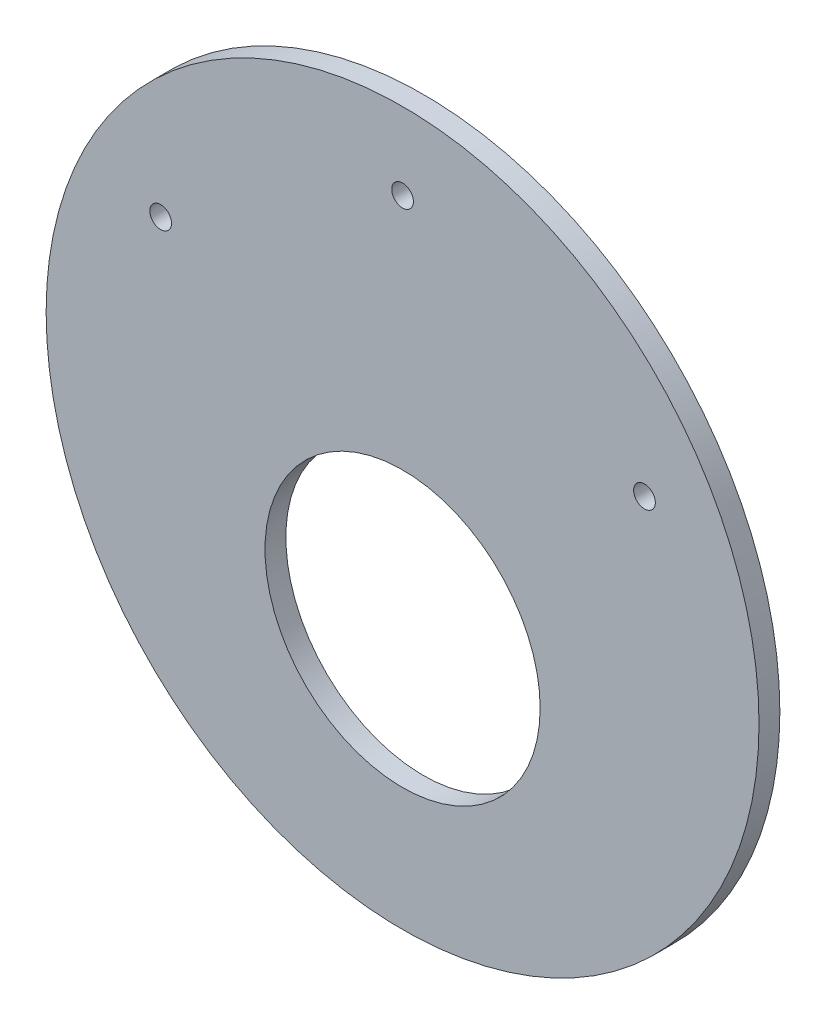
ISO-10303-21;
HEADER;
FILE_DESCRIPTION(('STEP AP214'),'2;1');
FILE_NAME('part.step','',(''),(''),'','','');
FILE_SCHEMA(('AUTOMOTIVE_DESIGN { 1 0 10303 214 1 1 1 1 }'));
ENDSEC;
DATA;
#1=APPLICATION_CONTEXT('core data for automotive mechanical design processes');
#2=APPLICATION_PROTOCOL_DEFINITION('international standard','automotive_design',2000,#1);
#3=PRODUCT_CONTEXT('',#1,'mechanical');
#4=PRODUCT('Part','Part','',(#3));
#5=PRODUCT_RELATED_PRODUCT_CATEGORY('part','',(#4));
#6=PRODUCT_DEFINITION_FORMATION('','',#4);
#7=PRODUCT_DEFINITION_CONTEXT('part definition',#1,'design');
#8=PRODUCT_DEFINITION('design','',#6,#7);
#9=PRODUCT_DEFINITION_SHAPE('','',#8);
#10=(LENGTH_UNIT() NAMED_UNIT(*) SI_UNIT(.MILLI.,.METRE.));
#11=(NAMED_UNIT(*) PLANE_ANGLE_UNIT() SI_UNIT($,.RADIAN.));
#12=(NAMED_UNIT(*) SI_UNIT($,.STERADIAN.) SOLID_ANGLE_UNIT());
#13=UNCERTAINTY_MEASURE_WITH_UNIT(LENGTH_MEASURE(1.E-05),#10,'distance_accuracy_value','');
#14=(GEOMETRIC_REPRESENTATION_CONTEXT(3) GLOBAL_UNCERTAINTY_ASSIGNED_CONTEXT((#13)) GLOBAL_UNIT_ASSIGNED_CONTEXT((#10,
#11,#12)) REPRESENTATION_CONTEXT('',''));
#15=CARTESIAN_POINT('',(0.,0.,0.));
#16=DIRECTION('',(0.,0.,1.));
#17=DIRECTION('',(1.,0.,0.));
#18=AXIS2_PLACEMENT_3D('',#15,#16,#17);
#19=CARTESIAN_POINT('',(0.,0.,5.));
#20=DIRECTION('',(0.,0.,-1.));
#21=DIRECTION('',(-1.,0.,0.));
#22=AXIS2_PLACEMENT_3D('',#19,#20,#21);
#23=CYLINDRICAL_SURFACE('',#22,85.5);
#24=CARTESIAN_POINT('',(0.,0.,5.));
#25=DIRECTION('',(0.,0.,1.));
#26=DIRECTION('',(1.,0.,0.));
#27=AXIS2_PLACEMENT_3D('',#24,#25,#26);
#28=CIRCLE('',#27,85.5);
#29=CARTESIAN_POINT('',(85.5,0.,5.));
#30=VERTEX_POINT('',#29);
#31=EDGE_CURVE('E10',#30,#30,#28,.T.);
#32=ORIENTED_EDGE('',*,*,#31,.F.);
#33=EDGE_LOOP('',(#32));
#34=FACE_BOUND('',#33,.T.);
#35=CARTESIAN_POINT('',(0.,0.,0.));
#36=DIRECTION('',(0.,0.,1.));
#37=DIRECTION('',(1.,0.,0.));
#38=AXIS2_PLACEMENT_3D('',#35,#36,#37);
#39=CIRCLE('',#38,85.5);
#40=CARTESIAN_POINT('',(85.5,0.,0.));
#41=VERTEX_POINT('',#40);
#42=EDGE_CURVE('E40',#41,#41,#39,.T.);
#43=ORIENTED_EDGE('',*,*,#42,.T.);
#44=EDGE_LOOP('',(#43));
#45=FACE_BOUND('',#44,.T.);
#46=ADVANCED_FACE('F37',(#34,#45),#23,.T.);
#47=CARTESIAN_POINT('',(0.,0.,5.));
#48=DIRECTION('',(0.,0.,1.));
#49=DIRECTION('',(1.,0.,0.));
#50=AXIS2_PLACEMENT_3D('',#47,#48,#49);
#51=PLANE('',#50);
#52=CARTESIAN_POINT('',(58.0237020535575,33.4999999999999,5.));
#53=DIRECTION('',(0.,0.,1.));
#54=DIRECTION('',(0.499999999999998,-0.86602540378444,0.));
#55=AXIS2_PLACEMENT_3D('',#52,#53,#54);
#56=CIRCLE('',#55,2.6);
#57=CARTESIAN_POINT('',(59.3237020535575,31.2483339501603,5.));
#58=VERTEX_POINT('',#57);
#59=EDGE_CURVE('E75',#58,#58,#56,.T.);
#60=ORIENTED_EDGE('',*,*,#59,.F.);
#61=EDGE_LOOP('',(#60));
#62=FACE_BOUND('',#61,.T.);
#63=CARTESIAN_POINT('',(-58.0237020535575,33.4999999999999,5.));
#64=DIRECTION('',(0.,0.,1.));
#65=DIRECTION('',(0.499999999999998,0.86602540378444,0.));
#66=AXIS2_PLACEMENT_3D('',#63,#64,#65);
#67=CIRCLE('',#66,2.6);
#68=CARTESIAN_POINT('',(-56.7237020535575,35.7516660498394,5.));
#69=VERTEX_POINT('',#68);
#70=EDGE_CURVE('E67',#69,#69,#67,.T.);
#71=ORIENTED_EDGE('',*,*,#70,.F.);
#72=EDGE_LOOP('',(#71));
#73=FACE_BOUND('',#72,.T.);
#74=CARTESIAN_POINT('',(0.,67.,5.));
#75=DIRECTION('',(0.,0.,1.));
#76=DIRECTION('',(1.,0.,0.));
#77=AXIS2_PLACEMENT_3D('',#74,#75,#76);
#78=CIRCLE('',#77,2.6);
#79=CARTESIAN_POINT('',(2.6,67.,5.));
#80=VERTEX_POINT('',#79);
#81=EDGE_CURVE('E59',#80,#80,#78,.T.);
#82=ORIENTED_EDGE('',*,*,#81,.F.);
#83=EDGE_LOOP('',(#82));
#84=FACE_BOUND('',#83,.T.);
#85=CARTESIAN_POINT('',(0.,-23.,5.));
#86=DIRECTION('',(0.,0.,1.));
#87=DIRECTION('',(1.,0.,0.));
#88=AXIS2_PLACEMENT_3D('',#85,#86,#87);
#89=CIRCLE('',#88,33.);
#90=CARTESIAN_POINT('',(33.,-23.,5.));
#91=VERTEX_POINT('',#90);
#92=EDGE_CURVE('E51',#91,#91,#89,.T.);
#93=ORIENTED_EDGE('',*,*,#92,.F.);
#94=EDGE_LOOP('',(#93));
#95=FACE_BOUND('',#94,.T.);
#96=ORIENTED_EDGE('',*,*,#31,.T.);
#97=EDGE_LOOP('',(#96));
#98=FACE_BOUND('',#97,.T.);
#99=ADVANCED_FACE('F93',(#62,#73,#84,#95,#98),#51,.T.);
#100=CARTESIAN_POINT('',(0.,0.,0.));
#101=DIRECTION('',(0.,0.,1.));
#102=DIRECTION('',(1.,0.,0.));
#103=AXIS2_PLACEMENT_3D('',#100,#101,#102);
#104=PLANE('',#103);
#105=CARTESIAN_POINT('',(58.0237020535575,33.4999999999999,0.));
#106=DIRECTION('',(0.,0.,1.));
#107=DIRECTION('',(0.499999999999998,-0.86602540378444,0.));
#108=AXIS2_PLACEMENT_3D('',#105,#106,#107);
#109=CIRCLE('',#108,2.6);
#110=CARTESIAN_POINT('',(59.3237020535575,31.2483339501603,0.));
#111=VERTEX_POINT('',#110);
#112=EDGE_CURVE('E71',#111,#111,#109,.T.);
#113=ORIENTED_EDGE('',*,*,#112,.T.);
#114=EDGE_LOOP('',(#113));
#115=FACE_BOUND('',#114,.T.);
#116=CARTESIAN_POINT('',(-58.0237020535575,33.4999999999999,0.));
#117=DIRECTION('',(0.,0.,1.));
#118=DIRECTION('',(0.499999999999998,0.86602540378444,0.));
#119=AXIS2_PLACEMENT_3D('',#116,#117,#118);
#120=CIRCLE('',#119,2.6);
#121=CARTESIAN_POINT('',(-56.7237020535575,35.7516660498394,0.));
#122=VERTEX_POINT('',#121);
#123=EDGE_CURVE('E63',#122,#122,#120,.T.);
#124=ORIENTED_EDGE('',*,*,#123,.T.);
#125=EDGE_LOOP('',(#124));
#126=FACE_BOUND('',#125,.T.);
#127=CARTESIAN_POINT('',(0.,67.,0.));
#128=DIRECTION('',(0.,0.,1.));
#129=DIRECTION('',(1.,0.,0.));
#130=AXIS2_PLACEMENT_3D('',#127,#128,#129);
#131=CIRCLE('',#130,2.6);
#132=CARTESIAN_POINT('',(2.6,67.,0.));
#133=VERTEX_POINT('',#132);
#134=EDGE_CURVE('E55',#133,#133,#131,.T.);
#135=ORIENTED_EDGE('',*,*,#134,.T.);
#136=EDGE_LOOP('',(#135));
#137=FACE_BOUND('',#136,.T.);
#138=CARTESIAN_POINT('',(0.,-23.,0.));
#139=DIRECTION('',(0.,0.,1.));
#140=DIRECTION('',(1.,0.,0.));
#141=AXIS2_PLACEMENT_3D('',#138,#139,#140);
#142=CIRCLE('',#141,33.);
#143=CARTESIAN_POINT('',(33.,-23.,0.));
#144=VERTEX_POINT('',#143);
#145=EDGE_CURVE('E49',#144,#144,#142,.T.);
#146=ORIENTED_EDGE('',*,*,#145,.T.);
#147=EDGE_LOOP('',(#146));
#148=FACE_BOUND('',#147,.T.);
#149=ORIENTED_EDGE('',*,*,#42,.F.);
#150=EDGE_LOOP('',(#149));
#151=FACE_BOUND('',#150,.T.);
#152=ADVANCED_FACE('F83',(#115,#126,#137,#148,#151),#104,.F.);
#153=CARTESIAN_POINT('',(0.,-23.,0.));
#154=DIRECTION('',(0.,0.,1.));
#155=DIRECTION('',(1.,0.,0.));
#156=AXIS2_PLACEMENT_3D('',#153,#154,#155);
#157=CYLINDRICAL_SURFACE('',#156,33.);
#158=ORIENTED_EDGE('',*,*,#145,.F.);
#159=EDGE_LOOP('',(#158));
#160=FACE_BOUND('',#159,.T.);
#161=ORIENTED_EDGE('',*,*,#92,.T.);
#162=EDGE_LOOP('',(#161));
#163=FACE_BOUND('',#162,.T.);
#164=ADVANCED_FACE('F103',(#160,#163),#157,.F.);
#165=CARTESIAN_POINT('',(0.,67.,0.));
#166=DIRECTION('',(0.,0.,1.));
#167=DIRECTION('',(1.,0.,0.));
#168=AXIS2_PLACEMENT_3D('',#165,#166,#167);
#169=CYLINDRICAL_SURFACE('',#168,2.6);
#170=ORIENTED_EDGE('',*,*,#134,.F.);
#171=EDGE_LOOP('',(#170));
#172=FACE_BOUND('',#171,.T.);
#173=ORIENTED_EDGE('',*,*,#81,.T.);
#174=EDGE_LOOP('',(#173));
#175=FACE_BOUND('',#174,.T.);
#176=ADVANCED_FACE('F105',(#172,#175),#169,.F.);
#177=CARTESIAN_POINT('',(-58.0237020535575,33.4999999999999,0.));
#178=DIRECTION('',(0.,0.,1.));
#179=DIRECTION('',(1.,0.,0.));
#180=AXIS2_PLACEMENT_3D('',#177,#178,#179);
#181=CYLINDRICAL_SURFACE('',#180,2.6);
#182=ORIENTED_EDGE('',*,*,#123,.F.);
#183=EDGE_LOOP('',(#182));
#184=FACE_BOUND('',#183,.T.);
#185=ORIENTED_EDGE('',*,*,#70,.T.);
#186=EDGE_LOOP('',(#185));
#187=FACE_BOUND('',#186,.T.);
#188=ADVANCED_FACE('F89',(#184,#187),#181,.F.);
#189=CARTESIAN_POINT('',(58.0237020535575,33.4999999999999,0.));
#190=DIRECTION('',(0.,0.,1.));
#191=DIRECTION('',(1.,0.,0.));
#192=AXIS2_PLACEMENT_3D('',#189,#190,#191);
#193=CYLINDRICAL_SURFACE('',#192,2.6);
#194=ORIENTED_EDGE('',*,*,#112,.F.);
#195=EDGE_LOOP('',(#194));
#196=FACE_BOUND('',#195,.T.);
#197=ORIENTED_EDGE('',*,*,#59,.T.);
#198=EDGE_LOOP('',(#197));
#199=FACE_BOUND('',#198,.T.);
#200=ADVANCED_FACE('F86',(#196,#199),#193,.F.);
#201=CLOSED_SHELL('',(#46,#99,#152,#164,#176,#188,#200));
#202=MANIFOLD_SOLID_BREP('B2',#201);
#203=ADVANCED_BREP_SHAPE_REPRESENTATION('',(#18,#202),#14);
#204=SHAPE_DEFINITION_REPRESENTATION(#9,#203);
ENDSEC;
END-ISO-10303-21;
